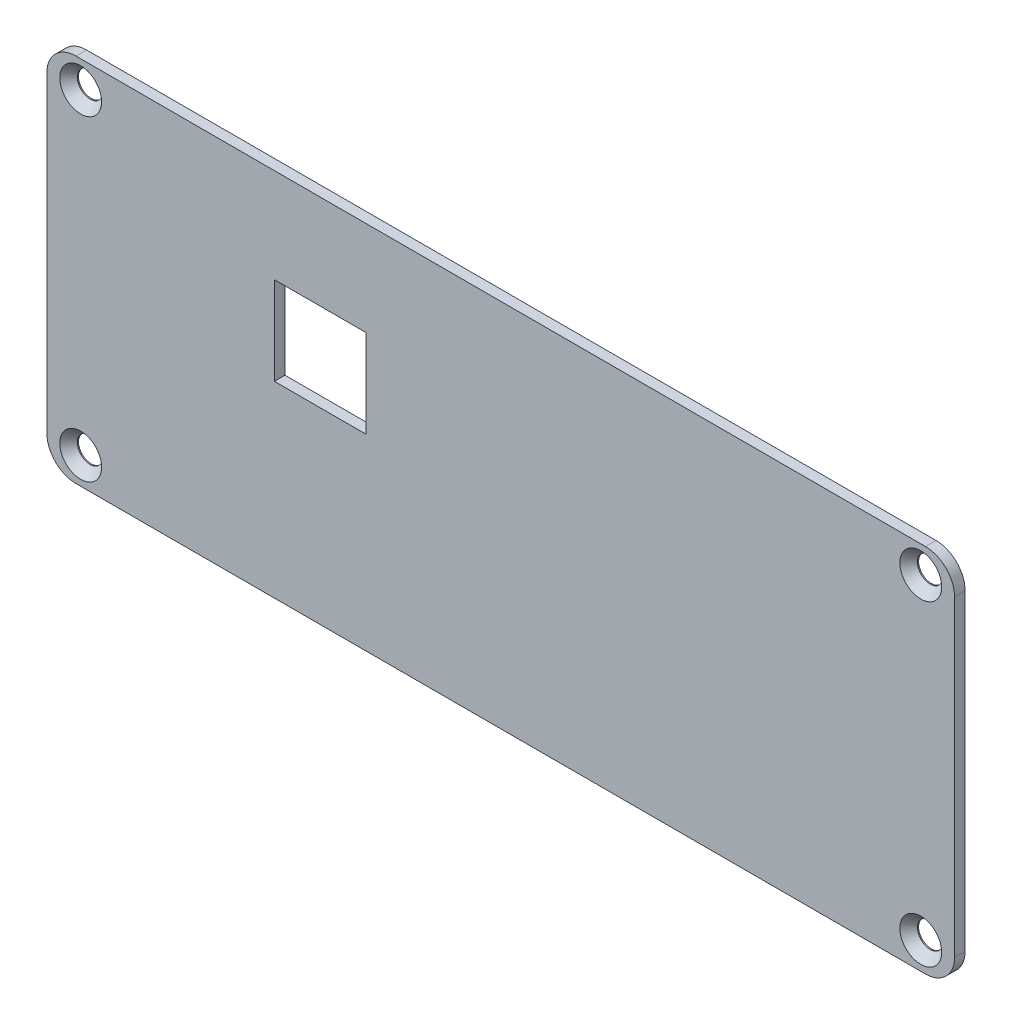
ISO-10303-21;
HEADER;
FILE_DESCRIPTION(('STEP AP214'),'2;1');
FILE_NAME('part.step','',(''),(''),'','','');
FILE_SCHEMA(('AUTOMOTIVE_DESIGN { 1 0 10303 214 1 1 1 1 }'));
ENDSEC;
DATA;
#1=APPLICATION_CONTEXT('core data for automotive mechanical design processes');
#2=APPLICATION_PROTOCOL_DEFINITION('international standard','automotive_design',2000,#1);
#3=PRODUCT_CONTEXT('',#1,'mechanical');
#4=PRODUCT('Part','Part','',(#3));
#5=PRODUCT_RELATED_PRODUCT_CATEGORY('part','',(#4));
#6=PRODUCT_DEFINITION_FORMATION('','',#4);
#7=PRODUCT_DEFINITION_CONTEXT('part definition',#1,'design');
#8=PRODUCT_DEFINITION('design','',#6,#7);
#9=PRODUCT_DEFINITION_SHAPE('','',#8);
#10=(LENGTH_UNIT() NAMED_UNIT(*) SI_UNIT(.MILLI.,.METRE.));
#11=(NAMED_UNIT(*) PLANE_ANGLE_UNIT() SI_UNIT($,.RADIAN.));
#12=(NAMED_UNIT(*) SI_UNIT($,.STERADIAN.) SOLID_ANGLE_UNIT());
#13=UNCERTAINTY_MEASURE_WITH_UNIT(LENGTH_MEASURE(1.E-05),#10,'distance_accuracy_value','');
#14=(GEOMETRIC_REPRESENTATION_CONTEXT(3) GLOBAL_UNCERTAINTY_ASSIGNED_CONTEXT((#13)) GLOBAL_UNIT_ASSIGNED_CONTEXT((#10,
#11,#12)) REPRESENTATION_CONTEXT('',''));
#15=CARTESIAN_POINT('',(0.,0.,0.));
#16=DIRECTION('',(0.,0.,1.));
#17=DIRECTION('',(1.,0.,0.));
#18=AXIS2_PLACEMENT_3D('',#15,#16,#17);
#19=CARTESIAN_POINT('',(0.,-12.985,1.45));
#20=DIRECTION('',(0.,1.,0.));
#21=DIRECTION('',(0.,0.,1.));
#22=AXIS2_PLACEMENT_3D('',#19,#20,#21);
#23=PLANE('',#22);
#24=DIRECTION('',(1.,0.,0.));
#25=VECTOR('',#24,1.);
#26=CARTESIAN_POINT('',(0.,-12.985,0.));
#27=LINE('',#26,#25);
#28=CARTESIAN_POINT('',(31.285,-12.985,0.));
#29=VERTEX_POINT('',#28);
#30=CARTESIAN_POINT('',(43.885,-12.985,0.));
#31=VERTEX_POINT('',#30);
#32=EDGE_CURVE('E149',#29,#31,#27,.T.);
#33=ORIENTED_EDGE('',*,*,#32,.T.);
#34=DIRECTION('',(0.,0.,-1.));
#35=VECTOR('',#34,1.);
#36=CARTESIAN_POINT('',(43.885,-12.985,1.45));
#37=LINE('',#36,#35);
#38=CARTESIAN_POINT('',(43.885,-12.985,1.45));
#39=VERTEX_POINT('',#38);
#40=EDGE_CURVE('E131',#39,#31,#37,.T.);
#41=ORIENTED_EDGE('',*,*,#40,.F.);
#42=DIRECTION('',(1.,0.,0.));
#43=VECTOR('',#42,1.);
#44=CARTESIAN_POINT('',(0.,-12.985,1.45));
#45=LINE('',#44,#43);
#46=CARTESIAN_POINT('',(31.285,-12.985,1.45));
#47=VERTEX_POINT('',#46);
#48=EDGE_CURVE('E138',#47,#39,#45,.T.);
#49=ORIENTED_EDGE('',*,*,#48,.F.);
#50=DIRECTION('',(0.,0.,-1.));
#51=VECTOR('',#50,1.);
#52=CARTESIAN_POINT('',(31.285,-12.985,1.45));
#53=LINE('',#52,#51);
#54=EDGE_CURVE('E212',#47,#29,#53,.T.);
#55=ORIENTED_EDGE('',*,*,#54,.T.);
#56=EDGE_LOOP('',(#33,#41,#49,#55));
#57=FACE_BOUND('',#56,.T.);
#58=ADVANCED_FACE('F37',(#57),#23,.F.);
#59=CARTESIAN_POINT('',(43.885,0.,1.45));
#60=DIRECTION('',(1.,0.,0.));
#61=DIRECTION('',(0.,0.,-1.));
#62=AXIS2_PLACEMENT_3D('',#59,#60,#61);
#63=PLANE('',#62);
#64=DIRECTION('',(0.,-1.,0.));
#65=VECTOR('',#64,1.);
#66=CARTESIAN_POINT('',(43.885,0.,0.));
#67=LINE('',#66,#65);
#68=CARTESIAN_POINT('',(43.885,-25.085,0.));
#69=VERTEX_POINT('',#68);
#70=EDGE_CURVE('E198',#31,#69,#67,.T.);
#71=ORIENTED_EDGE('',*,*,#70,.T.);
#72=DIRECTION('',(0.,0.,-1.));
#73=VECTOR('',#72,1.);
#74=CARTESIAN_POINT('',(43.885,-25.085,1.45));
#75=LINE('',#74,#73);
#76=CARTESIAN_POINT('',(43.885,-25.085,1.45));
#77=VERTEX_POINT('',#76);
#78=EDGE_CURVE('E133',#77,#69,#75,.T.);
#79=ORIENTED_EDGE('',*,*,#78,.F.);
#80=DIRECTION('',(0.,-1.,0.));
#81=VECTOR('',#80,1.);
#82=CARTESIAN_POINT('',(43.885,0.,1.45));
#83=LINE('',#82,#81);
#84=EDGE_CURVE('E126',#39,#77,#83,.T.);
#85=ORIENTED_EDGE('',*,*,#84,.F.);
#86=ORIENTED_EDGE('',*,*,#40,.T.);
#87=EDGE_LOOP('',(#71,#79,#85,#86));
#88=FACE_BOUND('',#87,.T.);
#89=ADVANCED_FACE('F129',(#88),#63,.F.);
#90=CARTESIAN_POINT('',(0.,-25.085,1.45));
#91=DIRECTION('',(0.,1.,0.));
#92=DIRECTION('',(0.,0.,1.));
#93=AXIS2_PLACEMENT_3D('',#90,#91,#92);
#94=PLANE('',#93);
#95=DIRECTION('',(1.,0.,0.));
#96=VECTOR('',#95,1.);
#97=CARTESIAN_POINT('',(0.,-25.085,0.));
#98=LINE('',#97,#96);
#99=CARTESIAN_POINT('',(31.285,-25.085,0.));
#100=VERTEX_POINT('',#99);
#101=EDGE_CURVE('E205',#100,#69,#98,.T.);
#102=ORIENTED_EDGE('',*,*,#101,.F.);
#103=DIRECTION('',(0.,0.,-1.));
#104=VECTOR('',#103,1.);
#105=CARTESIAN_POINT('',(31.285,-25.085,1.45));
#106=LINE('',#105,#104);
#107=CARTESIAN_POINT('',(31.285,-25.085,1.45));
#108=VERTEX_POINT('',#107);
#109=EDGE_CURVE('E154',#108,#100,#106,.T.);
#110=ORIENTED_EDGE('',*,*,#109,.F.);
#111=DIRECTION('',(1.,0.,0.));
#112=VECTOR('',#111,1.);
#113=CARTESIAN_POINT('',(0.,-25.085,1.45));
#114=LINE('',#113,#112);
#115=EDGE_CURVE('E137',#108,#77,#114,.T.);
#116=ORIENTED_EDGE('',*,*,#115,.T.);
#117=ORIENTED_EDGE('',*,*,#78,.T.);
#118=EDGE_LOOP('',(#102,#110,#116,#117));
#119=FACE_BOUND('',#118,.T.);
#120=ADVANCED_FACE('F218',(#119),#94,.T.);
#121=CARTESIAN_POINT('',(124.8,0.,1.45));
#122=DIRECTION('',(1.,0.,0.));
#123=DIRECTION('',(0.,0.,-1.));
#124=AXIS2_PLACEMENT_3D('',#121,#122,#123);
#125=PLANE('',#124);
#126=DIRECTION('',(0.,-1.,0.));
#127=VECTOR('',#126,1.);
#128=CARTESIAN_POINT('',(124.8,0.,0.));
#129=LINE('',#128,#127);
#130=CARTESIAN_POINT('',(124.8,-4.,0.));
#131=VERTEX_POINT('',#130);
#132=CARTESIAN_POINT('',(124.8,-46.9,0.));
#133=VERTEX_POINT('',#132);
#134=EDGE_CURVE('E292',#131,#133,#129,.T.);
#135=ORIENTED_EDGE('',*,*,#134,.F.);
#136=DIRECTION('',(0.,0.,-1.));
#137=VECTOR('',#136,1.);
#138=CARTESIAN_POINT('',(124.8,-4.,1.45));
#139=LINE('',#138,#137);
#140=CARTESIAN_POINT('',(124.8,-4.,1.45));
#141=VERTEX_POINT('',#140);
#142=EDGE_CURVE('E183',#131,#141,#139,.F.);
#143=ORIENTED_EDGE('',*,*,#142,.T.);
#144=DIRECTION('',(0.,-1.,0.));
#145=VECTOR('',#144,1.);
#146=CARTESIAN_POINT('',(124.8,0.,1.45));
#147=LINE('',#146,#145);
#148=CARTESIAN_POINT('',(124.8,-46.9,1.45));
#149=VERTEX_POINT('',#148);
#150=EDGE_CURVE('E211',#141,#149,#147,.T.);
#151=ORIENTED_EDGE('',*,*,#150,.T.);
#152=DIRECTION('',(0.,0.,-1.));
#153=VECTOR('',#152,1.);
#154=CARTESIAN_POINT('',(124.8,-46.9,0.));
#155=LINE('',#154,#153);
#156=EDGE_CURVE('E180',#149,#133,#155,.T.);
#157=ORIENTED_EDGE('',*,*,#156,.T.);
#158=EDGE_LOOP('',(#135,#143,#151,#157));
#159=FACE_BOUND('',#158,.T.);
#160=ADVANCED_FACE('F252',(#159),#125,.T.);
#161=CARTESIAN_POINT('',(0.,0.,1.45));
#162=DIRECTION('',(0.,1.,0.));
#163=DIRECTION('',(0.,0.,1.));
#164=AXIS2_PLACEMENT_3D('',#161,#162,#163);
#165=PLANE('',#164);
#166=DIRECTION('',(1.,0.,0.));
#167=VECTOR('',#166,1.);
#168=CARTESIAN_POINT('',(0.,0.,0.));
#169=LINE('',#168,#167);
#170=CARTESIAN_POINT('',(4.,0.,0.));
#171=VERTEX_POINT('',#170);
#172=CARTESIAN_POINT('',(120.8,0.,0.));
#173=VERTEX_POINT('',#172);
#174=EDGE_CURVE('E200',#171,#173,#169,.T.);
#175=ORIENTED_EDGE('',*,*,#174,.F.);
#176=DIRECTION('',(0.,0.,-1.));
#177=VECTOR('',#176,1.);
#178=CARTESIAN_POINT('',(4.,0.,1.45));
#179=LINE('',#178,#177);
#180=CARTESIAN_POINT('',(4.,0.,1.45));
#181=VERTEX_POINT('',#180);
#182=EDGE_CURVE('E171',#171,#181,#179,.F.);
#183=ORIENTED_EDGE('',*,*,#182,.T.);
#184=DIRECTION('',(1.,0.,0.));
#185=VECTOR('',#184,1.);
#186=CARTESIAN_POINT('',(0.,0.,1.45));
#187=LINE('',#186,#185);
#188=CARTESIAN_POINT('',(120.8,0.,1.45));
#189=VERTEX_POINT('',#188);
#190=EDGE_CURVE('E279',#181,#189,#187,.T.);
#191=ORIENTED_EDGE('',*,*,#190,.T.);
#192=DIRECTION('',(0.,0.,-1.));
#193=VECTOR('',#192,1.);
#194=CARTESIAN_POINT('',(120.8,0.,1.45));
#195=LINE('',#194,#193);
#196=EDGE_CURVE('E168',#189,#173,#195,.T.);
#197=ORIENTED_EDGE('',*,*,#196,.T.);
#198=EDGE_LOOP('',(#175,#183,#191,#197));
#199=FACE_BOUND('',#198,.T.);
#200=ADVANCED_FACE('F248',(#199),#165,.T.);
#201=CARTESIAN_POINT('',(0.,0.,1.45));
#202=DIRECTION('',(1.,0.,0.));
#203=DIRECTION('',(0.,1.,0.));
#204=AXIS2_PLACEMENT_3D('',#201,#202,#203);
#205=PLANE('',#204);
#206=DIRECTION('',(0.,-1.,0.));
#207=VECTOR('',#206,1.);
#208=CARTESIAN_POINT('',(0.,0.,1.45));
#209=LINE('',#208,#207);
#210=CARTESIAN_POINT('',(0.,-4.,1.45));
#211=VERTEX_POINT('',#210);
#212=CARTESIAN_POINT('',(0.,-46.9,1.45));
#213=VERTEX_POINT('',#212);
#214=EDGE_CURVE('E282',#211,#213,#209,.T.);
#215=ORIENTED_EDGE('',*,*,#214,.F.);
#216=DIRECTION('',(0.,0.,-1.));
#217=VECTOR('',#216,1.);
#218=CARTESIAN_POINT('',(0.,-4.,0.));
#219=LINE('',#218,#217);
#220=CARTESIAN_POINT('',(0.,-4.,0.));
#221=VERTEX_POINT('',#220);
#222=EDGE_CURVE('E152',#211,#221,#219,.T.);
#223=ORIENTED_EDGE('',*,*,#222,.T.);
#224=DIRECTION('',(0.,-1.,0.));
#225=VECTOR('',#224,1.);
#226=CARTESIAN_POINT('',(0.,0.,0.));
#227=LINE('',#226,#225);
#228=CARTESIAN_POINT('',(0.,-46.9,0.));
#229=VERTEX_POINT('',#228);
#230=EDGE_CURVE('E196',#221,#229,#227,.T.);
#231=ORIENTED_EDGE('',*,*,#230,.T.);
#232=DIRECTION('',(0.,0.,-1.));
#233=VECTOR('',#232,1.);
#234=CARTESIAN_POINT('',(0.,-46.9,1.45));
#235=LINE('',#234,#233);
#236=EDGE_CURVE('E150',#229,#213,#235,.F.);
#237=ORIENTED_EDGE('',*,*,#236,.T.);
#238=EDGE_LOOP('',(#215,#223,#231,#237));
#239=FACE_BOUND('',#238,.T.);
#240=ADVANCED_FACE('F245',(#239),#205,.F.);
#241=CARTESIAN_POINT('',(0.,-50.9,1.45));
#242=DIRECTION('',(0.,1.,0.));
#243=DIRECTION('',(0.,0.,1.));
#244=AXIS2_PLACEMENT_3D('',#241,#242,#243);
#245=PLANE('',#244);
#246=DIRECTION('',(1.,0.,0.));
#247=VECTOR('',#246,1.);
#248=CARTESIAN_POINT('',(0.,-50.9,0.));
#249=LINE('',#248,#247);
#250=CARTESIAN_POINT('',(4.00000000000001,-50.9,0.));
#251=VERTEX_POINT('',#250);
#252=CARTESIAN_POINT('',(120.8,-50.9,0.));
#253=VERTEX_POINT('',#252);
#254=EDGE_CURVE('E188',#251,#253,#249,.T.);
#255=ORIENTED_EDGE('',*,*,#254,.T.);
#256=DIRECTION('',(0.,0.,-1.));
#257=VECTOR('',#256,1.);
#258=CARTESIAN_POINT('',(120.8,-50.9,1.45));
#259=LINE('',#258,#257);
#260=CARTESIAN_POINT('',(120.8,-50.9,1.45));
#261=VERTEX_POINT('',#260);
#262=EDGE_CURVE('E11',#253,#261,#259,.F.);
#263=ORIENTED_EDGE('',*,*,#262,.T.);
#264=DIRECTION('',(1.,0.,0.));
#265=VECTOR('',#264,1.);
#266=CARTESIAN_POINT('',(0.,-50.9,1.45));
#267=LINE('',#266,#265);
#268=CARTESIAN_POINT('',(4.00000000000001,-50.9,1.45));
#269=VERTEX_POINT('',#268);
#270=EDGE_CURVE('E146',#269,#261,#267,.T.);
#271=ORIENTED_EDGE('',*,*,#270,.F.);
#272=DIRECTION('',(0.,0.,-1.));
#273=VECTOR('',#272,1.);
#274=CARTESIAN_POINT('',(4.00000000000001,-50.9,1.45));
#275=LINE('',#274,#273);
#276=EDGE_CURVE('E45',#269,#251,#275,.T.);
#277=ORIENTED_EDGE('',*,*,#276,.T.);
#278=EDGE_LOOP('',(#255,#263,#271,#277));
#279=FACE_BOUND('',#278,.T.);
#280=ADVANCED_FACE('F187',(#279),#245,.F.);
#281=CARTESIAN_POINT('',(31.285,0.,1.45));
#282=DIRECTION('',(1.,0.,0.));
#283=DIRECTION('',(0.,0.,-1.));
#284=AXIS2_PLACEMENT_3D('',#281,#282,#283);
#285=PLANE('',#284);
#286=DIRECTION('',(0.,-1.,0.));
#287=VECTOR('',#286,1.);
#288=CARTESIAN_POINT('',(31.285,0.,0.));
#289=LINE('',#288,#287);
#290=EDGE_CURVE('E208',#29,#100,#289,.T.);
#291=ORIENTED_EDGE('',*,*,#290,.F.);
#292=ORIENTED_EDGE('',*,*,#54,.F.);
#293=DIRECTION('',(0.,-1.,0.));
#294=VECTOR('',#293,1.);
#295=CARTESIAN_POINT('',(31.285,0.,1.45));
#296=LINE('',#295,#294);
#297=EDGE_CURVE('E144',#47,#108,#296,.T.);
#298=ORIENTED_EDGE('',*,*,#297,.T.);
#299=ORIENTED_EDGE('',*,*,#109,.T.);
#300=EDGE_LOOP('',(#291,#292,#298,#299));
#301=FACE_BOUND('',#300,.T.);
#302=ADVANCED_FACE('F216',(#301),#285,.T.);
#303=CARTESIAN_POINT('',(0.,0.,1.45));
#304=DIRECTION('',(0.,0.,1.));
#305=DIRECTION('',(1.,0.,0.));
#306=AXIS2_PLACEMENT_3D('',#303,#304,#305);
#307=PLANE('',#306);
#308=CARTESIAN_POINT('',(4.64999999999999,-3.7,1.45));
#309=DIRECTION('',(0.,0.,1.));
#310=DIRECTION('',(1.,0.,0.));
#311=AXIS2_PLACEMENT_3D('',#308,#309,#310);
#312=CIRCLE('',#311,2.875);
#313=CARTESIAN_POINT('',(7.52499999999999,-3.7,1.45));
#314=VERTEX_POINT('',#313);
#315=EDGE_CURVE('E335',#314,#314,#312,.T.);
#316=ORIENTED_EDGE('',*,*,#315,.F.);
#317=EDGE_LOOP('',(#316));
#318=FACE_BOUND('',#317,.T.);
#319=CARTESIAN_POINT('',(120.15,-3.7,1.45));
#320=DIRECTION('',(0.,0.,1.));
#321=DIRECTION('',(1.,0.,0.));
#322=AXIS2_PLACEMENT_3D('',#319,#320,#321);
#323=CIRCLE('',#322,2.875);
#324=CARTESIAN_POINT('',(123.025,-3.7,1.45));
#325=VERTEX_POINT('',#324);
#326=EDGE_CURVE('E327',#325,#325,#323,.T.);
#327=ORIENTED_EDGE('',*,*,#326,.F.);
#328=EDGE_LOOP('',(#327));
#329=FACE_BOUND('',#328,.T.);
#330=CARTESIAN_POINT('',(120.15,-47.2,1.45));
#331=DIRECTION('',(0.,0.,1.));
#332=DIRECTION('',(1.,0.,0.));
#333=AXIS2_PLACEMENT_3D('',#330,#331,#332);
#334=CIRCLE('',#333,2.875);
#335=CARTESIAN_POINT('',(123.025,-47.2,1.45));
#336=VERTEX_POINT('',#335);
#337=EDGE_CURVE('E318',#336,#336,#334,.T.);
#338=ORIENTED_EDGE('',*,*,#337,.F.);
#339=EDGE_LOOP('',(#338));
#340=FACE_BOUND('',#339,.T.);
#341=CARTESIAN_POINT('',(4.64999999999999,-47.2,1.45));
#342=DIRECTION('',(0.,0.,1.));
#343=DIRECTION('',(1.,0.,0.));
#344=AXIS2_PLACEMENT_3D('',#341,#342,#343);
#345=CIRCLE('',#344,2.875);
#346=CARTESIAN_POINT('',(7.52499999999999,-47.2,1.45));
#347=VERTEX_POINT('',#346);
#348=EDGE_CURVE('E306',#347,#347,#345,.T.);
#349=ORIENTED_EDGE('',*,*,#348,.F.);
#350=EDGE_LOOP('',(#349));
#351=FACE_BOUND('',#350,.T.);
#352=ORIENTED_EDGE('',*,*,#190,.F.);
#353=CARTESIAN_POINT('',(4.,-4.,1.45));
#354=DIRECTION('',(0.,0.,1.));
#355=DIRECTION('',(1.,0.,0.));
#356=AXIS2_PLACEMENT_3D('',#353,#354,#355);
#357=CIRCLE('',#356,4.);
#358=EDGE_CURVE('E178',#181,#211,#357,.T.);
#359=ORIENTED_EDGE('',*,*,#358,.T.);
#360=ORIENTED_EDGE('',*,*,#214,.T.);
#361=CARTESIAN_POINT('',(4.00000000000001,-46.9,1.45));
#362=DIRECTION('',(0.,0.,1.));
#363=DIRECTION('',(1.,0.,0.));
#364=AXIS2_PLACEMENT_3D('',#361,#362,#363);
#365=CIRCLE('',#364,4.);
#366=EDGE_CURVE('E57',#213,#269,#365,.T.);
#367=ORIENTED_EDGE('',*,*,#366,.T.);
#368=ORIENTED_EDGE('',*,*,#270,.T.);
#369=CARTESIAN_POINT('',(120.8,-46.9,1.45));
#370=DIRECTION('',(0.,0.,1.));
#371=DIRECTION('',(1.,0.,0.));
#372=AXIS2_PLACEMENT_3D('',#369,#370,#371);
#373=CIRCLE('',#372,4.);
#374=EDGE_CURVE('E174',#261,#149,#373,.T.);
#375=ORIENTED_EDGE('',*,*,#374,.T.);
#376=ORIENTED_EDGE('',*,*,#150,.F.);
#377=CARTESIAN_POINT('',(120.8,-4.,1.45));
#378=DIRECTION('',(0.,0.,1.));
#379=DIRECTION('',(1.,0.,0.));
#380=AXIS2_PLACEMENT_3D('',#377,#378,#379);
#381=CIRCLE('',#380,4.);
#382=EDGE_CURVE('E176',#141,#189,#381,.T.);
#383=ORIENTED_EDGE('',*,*,#382,.T.);
#384=EDGE_LOOP('',(#352,#359,#360,#367,#368,#375,#376,#383));
#385=FACE_BOUND('',#384,.T.);
#386=ORIENTED_EDGE('',*,*,#48,.T.);
#387=ORIENTED_EDGE('',*,*,#84,.T.);
#388=ORIENTED_EDGE('',*,*,#115,.F.);
#389=ORIENTED_EDGE('',*,*,#297,.F.);
#390=EDGE_LOOP('',(#386,#387,#388,#389));
#391=FACE_BOUND('',#390,.T.);
#392=ADVANCED_FACE('F142',(#318,#329,#340,#351,#385,#391),#307,.T.);
#393=CARTESIAN_POINT('',(0.,0.,0.));
#394=DIRECTION('',(0.,0.,1.));
#395=DIRECTION('',(1.,0.,0.));
#396=AXIS2_PLACEMENT_3D('',#393,#394,#395);
#397=PLANE('',#396);
#398=CARTESIAN_POINT('',(4.64999999999999,-3.7,0.));
#399=DIRECTION('',(0.,0.,1.));
#400=DIRECTION('',(1.,0.,0.));
#401=AXIS2_PLACEMENT_3D('',#398,#399,#400);
#402=CIRCLE('',#401,1.75);
#403=CARTESIAN_POINT('',(6.39999999999999,-3.7,0.));
#404=VERTEX_POINT('',#403);
#405=EDGE_CURVE('E330',#404,#404,#402,.T.);
#406=ORIENTED_EDGE('',*,*,#405,.T.);
#407=EDGE_LOOP('',(#406));
#408=FACE_BOUND('',#407,.T.);
#409=CARTESIAN_POINT('',(120.15,-3.7,0.));
#410=DIRECTION('',(0.,0.,1.));
#411=DIRECTION('',(1.,0.,0.));
#412=AXIS2_PLACEMENT_3D('',#409,#410,#411);
#413=CIRCLE('',#412,1.75);
#414=CARTESIAN_POINT('',(121.9,-3.7,0.));
#415=VERTEX_POINT('',#414);
#416=EDGE_CURVE('E321',#415,#415,#413,.T.);
#417=ORIENTED_EDGE('',*,*,#416,.T.);
#418=EDGE_LOOP('',(#417));
#419=FACE_BOUND('',#418,.T.);
#420=CARTESIAN_POINT('',(120.15,-47.2,0.));
#421=DIRECTION('',(0.,0.,1.));
#422=DIRECTION('',(1.,0.,0.));
#423=AXIS2_PLACEMENT_3D('',#420,#421,#422);
#424=CIRCLE('',#423,1.75);
#425=CARTESIAN_POINT('',(121.9,-47.2,0.));
#426=VERTEX_POINT('',#425);
#427=EDGE_CURVE('E310',#426,#426,#424,.T.);
#428=ORIENTED_EDGE('',*,*,#427,.T.);
#429=EDGE_LOOP('',(#428));
#430=FACE_BOUND('',#429,.T.);
#431=CARTESIAN_POINT('',(4.64999999999999,-47.2,0.));
#432=DIRECTION('',(0.,0.,1.));
#433=DIRECTION('',(1.,0.,0.));
#434=AXIS2_PLACEMENT_3D('',#431,#432,#433);
#435=CIRCLE('',#434,1.75);
#436=CARTESIAN_POINT('',(6.39999999999999,-47.2,0.));
#437=VERTEX_POINT('',#436);
#438=EDGE_CURVE('E285',#437,#437,#435,.T.);
#439=ORIENTED_EDGE('',*,*,#438,.T.);
#440=EDGE_LOOP('',(#439));
#441=FACE_BOUND('',#440,.T.);
#442=ORIENTED_EDGE('',*,*,#230,.F.);
#443=CARTESIAN_POINT('',(4.,-4.,0.));
#444=DIRECTION('',(0.,0.,1.));
#445=DIRECTION('',(1.,0.,0.));
#446=AXIS2_PLACEMENT_3D('',#443,#444,#445);
#447=CIRCLE('',#446,4.);
#448=EDGE_CURVE('E166',#221,#171,#447,.F.);
#449=ORIENTED_EDGE('',*,*,#448,.T.);
#450=ORIENTED_EDGE('',*,*,#174,.T.);
#451=CARTESIAN_POINT('',(120.8,-4.,0.));
#452=DIRECTION('',(0.,0.,1.));
#453=DIRECTION('',(1.,0.,0.));
#454=AXIS2_PLACEMENT_3D('',#451,#452,#453);
#455=CIRCLE('',#454,4.);
#456=EDGE_CURVE('E164',#173,#131,#455,.F.);
#457=ORIENTED_EDGE('',*,*,#456,.T.);
#458=ORIENTED_EDGE('',*,*,#134,.T.);
#459=CARTESIAN_POINT('',(120.8,-46.9,0.));
#460=DIRECTION('',(0.,0.,1.));
#461=DIRECTION('',(1.,0.,0.));
#462=AXIS2_PLACEMENT_3D('',#459,#460,#461);
#463=CIRCLE('',#462,4.);
#464=EDGE_CURVE('E162',#133,#253,#463,.F.);
#465=ORIENTED_EDGE('',*,*,#464,.T.);
#466=ORIENTED_EDGE('',*,*,#254,.F.);
#467=CARTESIAN_POINT('',(4.00000000000001,-46.9,0.));
#468=DIRECTION('',(0.,0.,1.));
#469=DIRECTION('',(1.,0.,0.));
#470=AXIS2_PLACEMENT_3D('',#467,#468,#469);
#471=CIRCLE('',#470,4.);
#472=EDGE_CURVE('E160',#251,#229,#471,.F.);
#473=ORIENTED_EDGE('',*,*,#472,.T.);
#474=EDGE_LOOP('',(#442,#449,#450,#457,#458,#465,#466,#473));
#475=FACE_BOUND('',#474,.T.);
#476=ORIENTED_EDGE('',*,*,#32,.F.);
#477=ORIENTED_EDGE('',*,*,#290,.T.);
#478=ORIENTED_EDGE('',*,*,#101,.T.);
#479=ORIENTED_EDGE('',*,*,#70,.F.);
#480=EDGE_LOOP('',(#476,#477,#478,#479));
#481=FACE_BOUND('',#480,.T.);
#482=ADVANCED_FACE('F192',(#408,#419,#430,#441,#475,#481),#397,.F.);
#483=CARTESIAN_POINT('',(4.64999999999999,-47.2,1.45));
#484=DIRECTION('',(0.,0.,1.));
#485=DIRECTION('',(1.,0.,0.));
#486=AXIS2_PLACEMENT_3D('',#483,#484,#485);
#487=CYLINDRICAL_SURFACE('',#486,1.75);
#488=ORIENTED_EDGE('',*,*,#438,.F.);
#489=EDGE_LOOP('',(#488));
#490=FACE_BOUND('',#489,.T.);
#491=CARTESIAN_POINT('',(4.64999999999999,-47.2,0.155835541876362));
#492=DIRECTION('',(0.,0.,1.));
#493=DIRECTION('',(1.,0.,0.));
#494=AXIS2_PLACEMENT_3D('',#491,#492,#493);
#495=CIRCLE('',#494,1.75);
#496=CARTESIAN_POINT('',(6.39999999999999,-47.2,0.155835541876362));
#497=VERTEX_POINT('',#496);
#498=EDGE_CURVE('E302',#497,#497,#495,.T.);
#499=ORIENTED_EDGE('',*,*,#498,.T.);
#500=EDGE_LOOP('',(#499));
#501=FACE_BOUND('',#500,.T.);
#502=ADVANCED_FACE('F220',(#490,#501),#487,.F.);
#503=CARTESIAN_POINT('',(4.64999999999999,-47.2,1.45));
#504=DIRECTION('',(0.,0.,1.));
#505=DIRECTION('',(1.,0.,0.));
#506=AXIS2_PLACEMENT_3D('',#503,#504,#505);
#507=CONICAL_SURFACE('',#506,2.875,0.715584993317675);
#508=ORIENTED_EDGE('',*,*,#498,.F.);
#509=EDGE_LOOP('',(#508));
#510=FACE_BOUND('',#509,.T.);
#511=ORIENTED_EDGE('',*,*,#348,.T.);
#512=EDGE_LOOP('',(#511));
#513=FACE_BOUND('',#512,.T.);
#514=ADVANCED_FACE('F227',(#510,#513),#507,.F.);
#515=CARTESIAN_POINT('',(120.15,-47.2,1.45));
#516=DIRECTION('',(0.,0.,1.));
#517=DIRECTION('',(1.,0.,0.));
#518=AXIS2_PLACEMENT_3D('',#515,#516,#517);
#519=CYLINDRICAL_SURFACE('',#518,1.75);
#520=ORIENTED_EDGE('',*,*,#427,.F.);
#521=EDGE_LOOP('',(#520));
#522=FACE_BOUND('',#521,.T.);
#523=CARTESIAN_POINT('',(120.15,-47.2,0.155835541876362));
#524=DIRECTION('',(0.,0.,1.));
#525=DIRECTION('',(1.,0.,0.));
#526=AXIS2_PLACEMENT_3D('',#523,#524,#525);
#527=CIRCLE('',#526,1.75);
#528=CARTESIAN_POINT('',(121.9,-47.2,0.155835541876362));
#529=VERTEX_POINT('',#528);
#530=EDGE_CURVE('E315',#529,#529,#527,.T.);
#531=ORIENTED_EDGE('',*,*,#530,.T.);
#532=EDGE_LOOP('',(#531));
#533=FACE_BOUND('',#532,.T.);
#534=ADVANCED_FACE('F347',(#522,#533),#519,.F.);
#535=CARTESIAN_POINT('',(120.15,-47.2,1.45));
#536=DIRECTION('',(0.,0.,1.));
#537=DIRECTION('',(1.,0.,0.));
#538=AXIS2_PLACEMENT_3D('',#535,#536,#537);
#539=CONICAL_SURFACE('',#538,2.875,0.715584993317675);
#540=ORIENTED_EDGE('',*,*,#530,.F.);
#541=EDGE_LOOP('',(#540));
#542=FACE_BOUND('',#541,.T.);
#543=ORIENTED_EDGE('',*,*,#337,.T.);
#544=EDGE_LOOP('',(#543));
#545=FACE_BOUND('',#544,.T.);
#546=ADVANCED_FACE('F353',(#542,#545),#539,.F.);
#547=CARTESIAN_POINT('',(120.15,-3.7,1.45));
#548=DIRECTION('',(0.,0.,1.));
#549=DIRECTION('',(1.,0.,0.));
#550=AXIS2_PLACEMENT_3D('',#547,#548,#549);
#551=CYLINDRICAL_SURFACE('',#550,1.75);
#552=ORIENTED_EDGE('',*,*,#416,.F.);
#553=EDGE_LOOP('',(#552));
#554=FACE_BOUND('',#553,.T.);
#555=CARTESIAN_POINT('',(120.15,-3.7,0.155835541876362));
#556=DIRECTION('',(0.,0.,1.));
#557=DIRECTION('',(1.,0.,0.));
#558=AXIS2_PLACEMENT_3D('',#555,#556,#557);
#559=CIRCLE('',#558,1.75);
#560=CARTESIAN_POINT('',(121.9,-3.7,0.155835541876362));
#561=VERTEX_POINT('',#560);
#562=EDGE_CURVE('E324',#561,#561,#559,.T.);
#563=ORIENTED_EDGE('',*,*,#562,.T.);
#564=EDGE_LOOP('',(#563));
#565=FACE_BOUND('',#564,.T.);
#566=ADVANCED_FACE('F359',(#554,#565),#551,.F.);
#567=CARTESIAN_POINT('',(120.15,-3.7,1.45));
#568=DIRECTION('',(0.,0.,1.));
#569=DIRECTION('',(1.,0.,0.));
#570=AXIS2_PLACEMENT_3D('',#567,#568,#569);
#571=CONICAL_SURFACE('',#570,2.875,0.715584993317675);
#572=ORIENTED_EDGE('',*,*,#562,.F.);
#573=EDGE_LOOP('',(#572));
#574=FACE_BOUND('',#573,.T.);
#575=ORIENTED_EDGE('',*,*,#326,.T.);
#576=EDGE_LOOP('',(#575));
#577=FACE_BOUND('',#576,.T.);
#578=ADVANCED_FACE('F363',(#574,#577),#571,.F.);
#579=CARTESIAN_POINT('',(4.64999999999999,-3.7,1.45));
#580=DIRECTION('',(0.,0.,1.));
#581=DIRECTION('',(1.,0.,0.));
#582=AXIS2_PLACEMENT_3D('',#579,#580,#581);
#583=CYLINDRICAL_SURFACE('',#582,1.75);
#584=ORIENTED_EDGE('',*,*,#405,.F.);
#585=EDGE_LOOP('',(#584));
#586=FACE_BOUND('',#585,.T.);
#587=CARTESIAN_POINT('',(4.64999999999999,-3.7,0.155835541876362));
#588=DIRECTION('',(0.,0.,1.));
#589=DIRECTION('',(1.,0.,0.));
#590=AXIS2_PLACEMENT_3D('',#587,#588,#589);
#591=CIRCLE('',#590,1.75);
#592=CARTESIAN_POINT('',(6.39999999999999,-3.7,0.155835541876362));
#593=VERTEX_POINT('',#592);
#594=EDGE_CURVE('E332',#593,#593,#591,.T.);
#595=ORIENTED_EDGE('',*,*,#594,.T.);
#596=EDGE_LOOP('',(#595));
#597=FACE_BOUND('',#596,.T.);
#598=ADVANCED_FACE('F367',(#586,#597),#583,.F.);
#599=CARTESIAN_POINT('',(4.64999999999999,-3.7,1.45));
#600=DIRECTION('',(0.,0.,1.));
#601=DIRECTION('',(1.,0.,0.));
#602=AXIS2_PLACEMENT_3D('',#599,#600,#601);
#603=CONICAL_SURFACE('',#602,2.875,0.715584993317675);
#604=ORIENTED_EDGE('',*,*,#594,.F.);
#605=EDGE_LOOP('',(#604));
#606=FACE_BOUND('',#605,.T.);
#607=ORIENTED_EDGE('',*,*,#315,.T.);
#608=EDGE_LOOP('',(#607));
#609=FACE_BOUND('',#608,.T.);
#610=ADVANCED_FACE('F261',(#606,#609),#603,.F.);
#611=CARTESIAN_POINT('',(4.,-4.,1.45));
#612=DIRECTION('',(0.,0.,1.));
#613=DIRECTION('',(1.,0.,0.));
#614=AXIS2_PLACEMENT_3D('',#611,#612,#613);
#615=CYLINDRICAL_SURFACE('',#614,4.);
#616=ORIENTED_EDGE('',*,*,#358,.F.);
#617=ORIENTED_EDGE('',*,*,#182,.F.);
#618=ORIENTED_EDGE('',*,*,#448,.F.);
#619=ORIENTED_EDGE('',*,*,#222,.F.);
#620=EDGE_LOOP('',(#616,#617,#618,#619));
#621=FACE_BOUND('',#620,.T.);
#622=ADVANCED_FACE('F257',(#621),#615,.T.);
#623=CARTESIAN_POINT('',(120.8,-4.,1.45));
#624=DIRECTION('',(0.,0.,-1.));
#625=DIRECTION('',(-1.,0.,0.));
#626=AXIS2_PLACEMENT_3D('',#623,#624,#625);
#627=CYLINDRICAL_SURFACE('',#626,4.);
#628=ORIENTED_EDGE('',*,*,#382,.F.);
#629=ORIENTED_EDGE('',*,*,#142,.F.);
#630=ORIENTED_EDGE('',*,*,#456,.F.);
#631=ORIENTED_EDGE('',*,*,#196,.F.);
#632=EDGE_LOOP('',(#628,#629,#630,#631));
#633=FACE_BOUND('',#632,.T.);
#634=ADVANCED_FACE('F260',(#633),#627,.T.);
#635=CARTESIAN_POINT('',(120.8,-46.9,1.45));
#636=DIRECTION('',(0.,0.,1.));
#637=DIRECTION('',(1.,0.,0.));
#638=AXIS2_PLACEMENT_3D('',#635,#636,#637);
#639=CYLINDRICAL_SURFACE('',#638,4.);
#640=ORIENTED_EDGE('',*,*,#374,.F.);
#641=ORIENTED_EDGE('',*,*,#262,.F.);
#642=ORIENTED_EDGE('',*,*,#464,.F.);
#643=ORIENTED_EDGE('',*,*,#156,.F.);
#644=EDGE_LOOP('',(#640,#641,#642,#643));
#645=FACE_BOUND('',#644,.T.);
#646=ADVANCED_FACE('F264',(#645),#639,.T.);
#647=CARTESIAN_POINT('',(4.00000000000001,-46.9,1.45));
#648=DIRECTION('',(0.,0.,-1.));
#649=DIRECTION('',(-1.,0.,0.));
#650=AXIS2_PLACEMENT_3D('',#647,#648,#649);
#651=CYLINDRICAL_SURFACE('',#650,4.);
#652=ORIENTED_EDGE('',*,*,#366,.F.);
#653=ORIENTED_EDGE('',*,*,#236,.F.);
#654=ORIENTED_EDGE('',*,*,#472,.F.);
#655=ORIENTED_EDGE('',*,*,#276,.F.);
#656=EDGE_LOOP('',(#652,#653,#654,#655));
#657=FACE_BOUND('',#656,.T.);
#658=ADVANCED_FACE('F39',(#657),#651,.T.);
#659=CLOSED_SHELL('',(#58,#89,#120,#160,#200,#240,#280,#302,#392,#482,#502,#514,#534,#546,#566,
#578,#598,#610,#622,#634,#646,#658));
#660=MANIFOLD_SOLID_BREP('B2',#659);
#661=ADVANCED_BREP_SHAPE_REPRESENTATION('',(#18,#660),#14);
#662=SHAPE_DEFINITION_REPRESENTATION(#9,#661);
ENDSEC;
END-ISO-10303-21;
